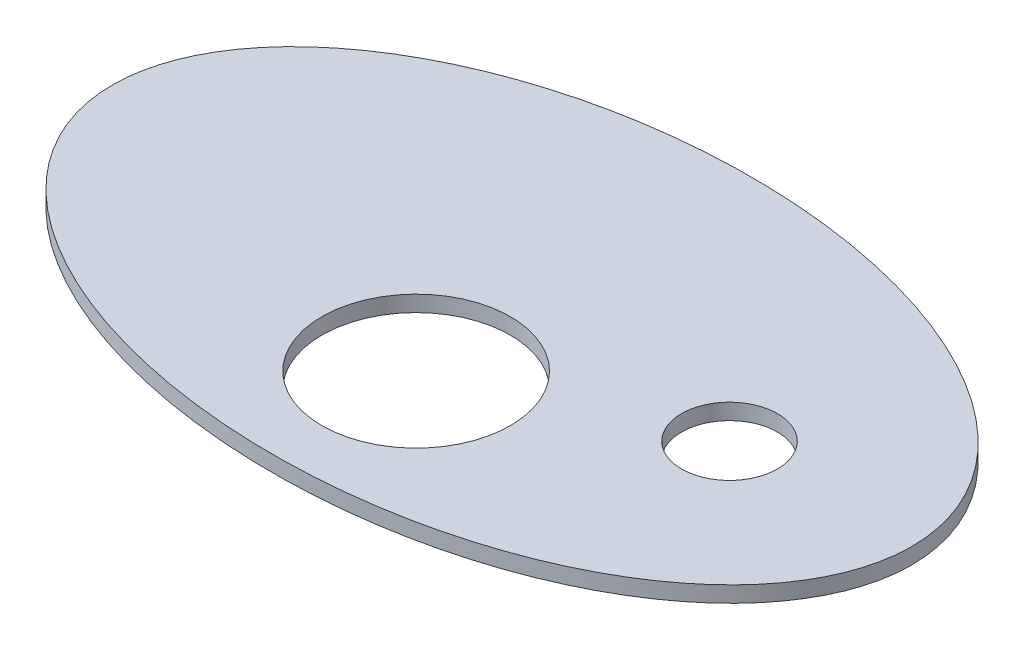
ISO-10303-21;
HEADER;
FILE_DESCRIPTION(('STEP AP214'),'2;1');
FILE_NAME('part.step','',(''),(''),'','','');
FILE_SCHEMA(('AUTOMOTIVE_DESIGN { 1 0 10303 214 1 1 1 1 }'));
ENDSEC;
DATA;
#1=APPLICATION_CONTEXT('core data for automotive mechanical design processes');
#2=APPLICATION_PROTOCOL_DEFINITION('international standard','automotive_design',2000,#1);
#3=PRODUCT_CONTEXT('',#1,'mechanical');
#4=PRODUCT('Part','Part','',(#3));
#5=PRODUCT_RELATED_PRODUCT_CATEGORY('part','',(#4));
#6=PRODUCT_DEFINITION_FORMATION('','',#4);
#7=PRODUCT_DEFINITION_CONTEXT('part definition',#1,'design');
#8=PRODUCT_DEFINITION('design','',#6,#7);
#9=PRODUCT_DEFINITION_SHAPE('','',#8);
#10=(LENGTH_UNIT() NAMED_UNIT(*) SI_UNIT(.MILLI.,.METRE.));
#11=(NAMED_UNIT(*) PLANE_ANGLE_UNIT() SI_UNIT($,.RADIAN.));
#12=(NAMED_UNIT(*) SI_UNIT($,.STERADIAN.) SOLID_ANGLE_UNIT());
#13=UNCERTAINTY_MEASURE_WITH_UNIT(LENGTH_MEASURE(1.E-05),#10,'distance_accuracy_value','');
#14=(GEOMETRIC_REPRESENTATION_CONTEXT(3) GLOBAL_UNCERTAINTY_ASSIGNED_CONTEXT((#13)) GLOBAL_UNIT_ASSIGNED_CONTEXT((#10,
#11,#12)) REPRESENTATION_CONTEXT('',''));
#15=CARTESIAN_POINT('',(0.,0.,0.));
#16=DIRECTION('',(0.,0.,1.));
#17=DIRECTION('',(1.,0.,0.));
#18=AXIS2_PLACEMENT_3D('',#15,#16,#17);
#19=CARTESIAN_POINT('',(0.,5.,0.));
#20=DIRECTION('',(0.,1.,0.));
#21=DIRECTION('',(1.,0.,0.));
#22=AXIS2_PLACEMENT_3D('',#19,#20,#21);
#23=ELLIPSE('',#22,125.,75.);
#24=DIRECTION('',(0.,-1.,0.));
#25=VECTOR('',#24,1.);
#26=SURFACE_OF_LINEAR_EXTRUSION('',#23,#25);
#27=CARTESIAN_POINT('',(125.,5.,0.));
#28=VERTEX_POINT('',#27);
#29=EDGE_CURVE('E10',#28,#28,#23,.T.);
#30=ORIENTED_EDGE('',*,*,#29,.F.);
#31=EDGE_LOOP('',(#30));
#32=FACE_BOUND('',#31,.T.);
#33=CARTESIAN_POINT('',(0.,0.,0.));
#34=DIRECTION('',(0.,1.,0.));
#35=DIRECTION('',(1.,0.,0.));
#36=AXIS2_PLACEMENT_3D('',#33,#34,#35);
#37=ELLIPSE('',#36,125.,75.);
#38=CARTESIAN_POINT('',(125.,0.,0.));
#39=VERTEX_POINT('',#38);
#40=EDGE_CURVE('E35',#39,#39,#37,.T.);
#41=ORIENTED_EDGE('',*,*,#40,.T.);
#42=EDGE_LOOP('',(#41));
#43=FACE_BOUND('',#42,.T.);
#44=ADVANCED_FACE('F31',(#32,#43),#26,.F.);
#45=CARTESIAN_POINT('',(0.,5.,0.));
#46=DIRECTION('',(0.,1.,0.));
#47=DIRECTION('',(0.,0.,1.));
#48=AXIS2_PLACEMENT_3D('',#45,#46,#47);
#49=PLANE('',#48);
#50=CARTESIAN_POINT('',(0.,5.,30.));
#51=DIRECTION('',(0.,1.,0.));
#52=DIRECTION('',(0.,0.,1.));
#53=AXIS2_PLACEMENT_3D('',#50,#51,#52);
#54=CIRCLE('',#53,29.5);
#55=CARTESIAN_POINT('',(0.,5.,59.5));
#56=VERTEX_POINT('',#55);
#57=EDGE_CURVE('E50',#56,#56,#54,.T.);
#58=ORIENTED_EDGE('',*,*,#57,.F.);
#59=EDGE_LOOP('',(#58));
#60=FACE_BOUND('',#59,.T.);
#61=CARTESIAN_POINT('',(68.,5.,0.));
#62=DIRECTION('',(0.,1.,0.));
#63=DIRECTION('',(0.,0.,1.));
#64=AXIS2_PLACEMENT_3D('',#61,#62,#63);
#65=CIRCLE('',#64,15.);
#66=CARTESIAN_POINT('',(68.,5.,15.));
#67=VERTEX_POINT('',#66);
#68=EDGE_CURVE('E44',#67,#67,#65,.T.);
#69=ORIENTED_EDGE('',*,*,#68,.F.);
#70=EDGE_LOOP('',(#69));
#71=FACE_BOUND('',#70,.T.);
#72=ORIENTED_EDGE('',*,*,#29,.T.);
#73=EDGE_LOOP('',(#72));
#74=FACE_BOUND('',#73,.T.);
#75=ADVANCED_FACE('F66',(#60,#71,#74),#49,.T.);
#76=CARTESIAN_POINT('',(0.,0.,0.));
#77=DIRECTION('',(0.,1.,0.));
#78=DIRECTION('',(0.,0.,1.));
#79=AXIS2_PLACEMENT_3D('',#76,#77,#78);
#80=PLANE('',#79);
#81=CARTESIAN_POINT('',(0.,0.,30.));
#82=DIRECTION('',(0.,1.,0.));
#83=DIRECTION('',(0.,0.,1.));
#84=AXIS2_PLACEMENT_3D('',#81,#82,#83);
#85=CIRCLE('',#84,29.5);
#86=CARTESIAN_POINT('',(0.,0.,59.5));
#87=VERTEX_POINT('',#86);
#88=EDGE_CURVE('E41',#87,#87,#85,.T.);
#89=ORIENTED_EDGE('',*,*,#88,.T.);
#90=EDGE_LOOP('',(#89));
#91=FACE_BOUND('',#90,.T.);
#92=CARTESIAN_POINT('',(68.,0.,0.));
#93=DIRECTION('',(0.,1.,0.));
#94=DIRECTION('',(0.,0.,1.));
#95=AXIS2_PLACEMENT_3D('',#92,#93,#94);
#96=CIRCLE('',#95,15.);
#97=CARTESIAN_POINT('',(68.,0.,15.));
#98=VERTEX_POINT('',#97);
#99=EDGE_CURVE('E47',#98,#98,#96,.T.);
#100=ORIENTED_EDGE('',*,*,#99,.T.);
#101=EDGE_LOOP('',(#100));
#102=FACE_BOUND('',#101,.T.);
#103=ORIENTED_EDGE('',*,*,#40,.F.);
#104=EDGE_LOOP('',(#103));
#105=FACE_BOUND('',#104,.T.);
#106=ADVANCED_FACE('F56',(#91,#102,#105),#80,.F.);
#107=CARTESIAN_POINT('',(68.,0.,0.));
#108=DIRECTION('',(0.,1.,0.));
#109=DIRECTION('',(0.,0.,1.));
#110=AXIS2_PLACEMENT_3D('',#107,#108,#109);
#111=CYLINDRICAL_SURFACE('',#110,15.);
#112=ORIENTED_EDGE('',*,*,#99,.F.);
#113=EDGE_LOOP('',(#112));
#114=FACE_BOUND('',#113,.T.);
#115=ORIENTED_EDGE('',*,*,#68,.T.);
#116=EDGE_LOOP('',(#115));
#117=FACE_BOUND('',#116,.T.);
#118=ADVANCED_FACE('F62',(#114,#117),#111,.F.);
#119=CARTESIAN_POINT('',(0.,0.,30.));
#120=DIRECTION('',(0.,1.,0.));
#121=DIRECTION('',(0.,0.,1.));
#122=AXIS2_PLACEMENT_3D('',#119,#120,#121);
#123=CYLINDRICAL_SURFACE('',#122,29.5);
#124=ORIENTED_EDGE('',*,*,#88,.F.);
#125=EDGE_LOOP('',(#124));
#126=FACE_BOUND('',#125,.T.);
#127=ORIENTED_EDGE('',*,*,#57,.T.);
#128=EDGE_LOOP('',(#127));
#129=FACE_BOUND('',#128,.T.);
#130=ADVANCED_FACE('F59',(#126,#129),#123,.F.);
#131=CLOSED_SHELL('',(#44,#75,#106,#118,#130));
#132=MANIFOLD_SOLID_BREP('B2',#131);
#133=ADVANCED_BREP_SHAPE_REPRESENTATION('',(#18,#132),#14);
#134=SHAPE_DEFINITION_REPRESENTATION(#9,#133);
ENDSEC;
END-ISO-10303-21;
